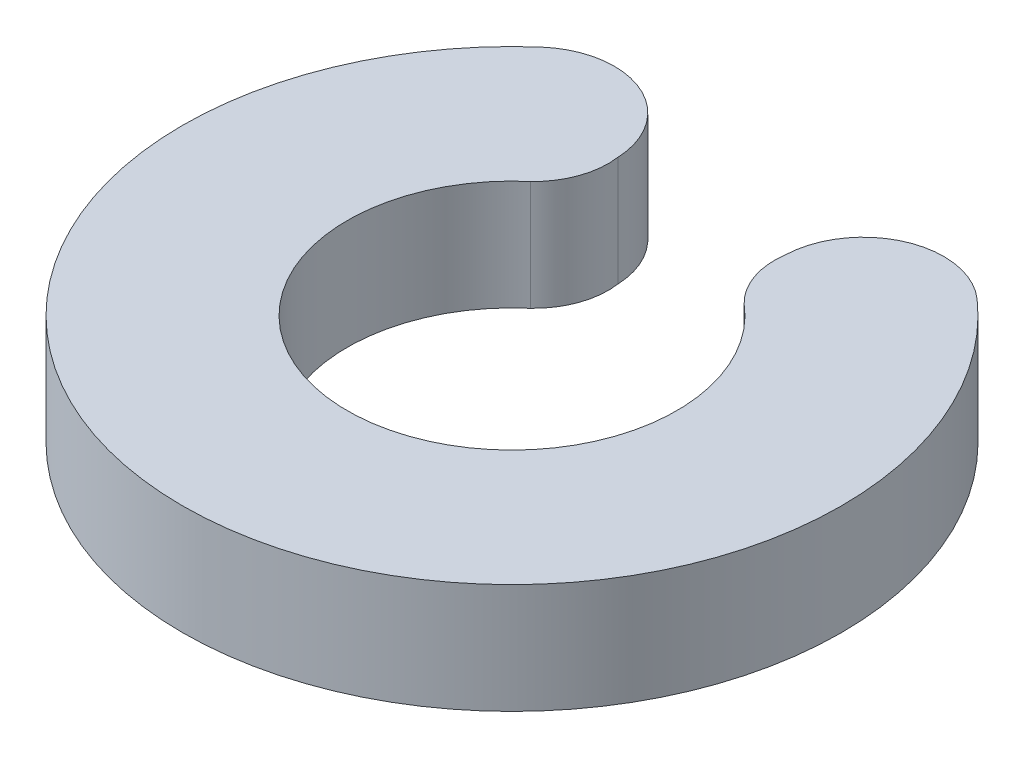
ISO-10303-21;
HEADER;
FILE_DESCRIPTION(('STEP AP214'),'2;1');
FILE_NAME('part.step','',(''),(''),'','','');
FILE_SCHEMA(('AUTOMOTIVE_DESIGN { 1 0 10303 214 1 1 1 1 }'));
ENDSEC;
DATA;
#1=APPLICATION_CONTEXT('core data for automotive mechanical design processes');
#2=APPLICATION_PROTOCOL_DEFINITION('international standard','automotive_design',2000,#1);
#3=PRODUCT_CONTEXT('',#1,'mechanical');
#4=PRODUCT('Part','Part','',(#3));
#5=PRODUCT_RELATED_PRODUCT_CATEGORY('part','',(#4));
#6=PRODUCT_DEFINITION_FORMATION('','',#4);
#7=PRODUCT_DEFINITION_CONTEXT('part definition',#1,'design');
#8=PRODUCT_DEFINITION('design','',#6,#7);
#9=PRODUCT_DEFINITION_SHAPE('','',#8);
#10=(LENGTH_UNIT() NAMED_UNIT(*) SI_UNIT(.MILLI.,.METRE.));
#11=(NAMED_UNIT(*) PLANE_ANGLE_UNIT() SI_UNIT($,.RADIAN.));
#12=(NAMED_UNIT(*) SI_UNIT($,.STERADIAN.) SOLID_ANGLE_UNIT());
#13=UNCERTAINTY_MEASURE_WITH_UNIT(LENGTH_MEASURE(1.E-05),#10,'distance_accuracy_value','');
#14=(GEOMETRIC_REPRESENTATION_CONTEXT(3) GLOBAL_UNCERTAINTY_ASSIGNED_CONTEXT((#13)) GLOBAL_UNIT_ASSIGNED_CONTEXT((#10,
#11,#12)) REPRESENTATION_CONTEXT('',''));
#15=CARTESIAN_POINT('',(0.,0.,0.));
#16=DIRECTION('',(0.,0.,1.));
#17=DIRECTION('',(1.,0.,0.));
#18=AXIS2_PLACEMENT_3D('',#15,#16,#17);
#19=CARTESIAN_POINT('',(2.85767186051075,2.,-3.26379282396494));
#20=DIRECTION('',(0.,-1.,0.));
#21=DIRECTION('',(0.,0.,-1.));
#22=AXIS2_PLACEMENT_3D('',#19,#20,#21);
#23=CYLINDRICAL_SURFACE('',#22,1.33980160261541);
#24=CARTESIAN_POINT('',(2.85767186051075,0.,-3.26379282396494));
#25=DIRECTION('',(0.,1.,0.));
#26=DIRECTION('',(0.,0.,1.));
#27=AXIS2_PLACEMENT_3D('',#24,#25,#26);
#28=CIRCLE('',#27,1.33980160261541);
#29=CARTESIAN_POINT('',(1.93296965263951,0.,-2.29425986365422));
#30=VERTEX_POINT('',#29);
#31=CARTESIAN_POINT('',(1.53197549990226,0.,-3.45769355588777));
#32=VERTEX_POINT('',#31);
#33=EDGE_CURVE('E115',#30,#32,#28,.F.);
#34=ORIENTED_EDGE('',*,*,#33,.F.);
#35=DIRECTION('',(0.,-1.,0.));
#36=VECTOR('',#35,1.);
#37=CARTESIAN_POINT('',(1.93296965263951,2.,-2.29425986365422));
#38=LINE('',#37,#36);
#39=CARTESIAN_POINT('',(1.93296965263951,2.,-2.29425986365422));
#40=VERTEX_POINT('',#39);
#41=EDGE_CURVE('E11',#40,#30,#38,.T.);
#42=ORIENTED_EDGE('',*,*,#41,.F.);
#43=CARTESIAN_POINT('',(2.85767186051075,2.,-3.26379282396494));
#44=DIRECTION('',(0.,1.,0.));
#45=DIRECTION('',(0.,0.,1.));
#46=AXIS2_PLACEMENT_3D('',#43,#44,#45);
#47=CIRCLE('',#46,1.33980160261541);
#48=CARTESIAN_POINT('',(1.53197549990226,2.,-3.45769355588777));
#49=VERTEX_POINT('',#48);
#50=EDGE_CURVE('E127',#40,#49,#47,.F.);
#51=ORIENTED_EDGE('',*,*,#50,.T.);
#52=DIRECTION('',(0.,-1.,0.));
#53=VECTOR('',#52,1.);
#54=CARTESIAN_POINT('',(1.53197549990226,2.,-3.45769355588777));
#55=LINE('',#54,#53);
#56=EDGE_CURVE('E79',#49,#32,#55,.T.);
#57=ORIENTED_EDGE('',*,*,#56,.T.);
#58=EDGE_LOOP('',(#34,#42,#51,#57));
#59=FACE_BOUND('',#58,.T.);
#60=ADVANCED_FACE('F34',(#59),#23,.T.);
#61=CARTESIAN_POINT('',(0.,2.,0.));
#62=DIRECTION('',(0.,-1.,0.));
#63=DIRECTION('',(0.,0.,-1.));
#64=AXIS2_PLACEMENT_3D('',#61,#62,#63);
#65=CYLINDRICAL_SURFACE('',#64,3.);
#66=CARTESIAN_POINT('',(0.,0.,0.));
#67=DIRECTION('',(0.,1.,0.));
#68=DIRECTION('',(0.,0.,1.));
#69=AXIS2_PLACEMENT_3D('',#66,#67,#68);
#70=CIRCLE('',#69,3.);
#71=CARTESIAN_POINT('',(-1.94534353459678,0.,-2.28377725104759));
#72=VERTEX_POINT('',#71);
#73=EDGE_CURVE('E118',#72,#30,#70,.T.);
#74=ORIENTED_EDGE('',*,*,#73,.F.);
#75=DIRECTION('',(0.,-1.,0.));
#76=VECTOR('',#75,1.);
#77=CARTESIAN_POINT('',(-1.94534353459678,2.,-2.28377725104759));
#78=LINE('',#77,#76);
#79=CARTESIAN_POINT('',(-1.94534353459678,2.,-2.28377725104759));
#80=VERTEX_POINT('',#79);
#81=EDGE_CURVE('E42',#80,#72,#78,.T.);
#82=ORIENTED_EDGE('',*,*,#81,.F.);
#83=CARTESIAN_POINT('',(0.,2.,0.));
#84=DIRECTION('',(0.,1.,0.));
#85=DIRECTION('',(0.,0.,1.));
#86=AXIS2_PLACEMENT_3D('',#83,#84,#85);
#87=CIRCLE('',#86,3.);
#88=EDGE_CURVE('E139',#80,#40,#87,.T.);
#89=ORIENTED_EDGE('',*,*,#88,.T.);
#90=ORIENTED_EDGE('',*,*,#41,.T.);
#91=EDGE_LOOP('',(#74,#82,#89,#90));
#92=FACE_BOUND('',#91,.T.);
#93=ADVANCED_FACE('F138',(#92),#65,.F.);
#94=CARTESIAN_POINT('',(-2.88155859532922,2.,-3.273181424374));
#95=DIRECTION('',(0.,-1.,0.));
#96=DIRECTION('',(0.,0.,-1.));
#97=AXIS2_PLACEMENT_3D('',#94,#95,#96);
#98=CYLINDRICAL_SURFACE('',#97,1.36213775299635);
#99=CARTESIAN_POINT('',(-2.88155859532922,0.,-3.273181424374));
#100=DIRECTION('',(0.,1.,0.));
#101=DIRECTION('',(0.,0.,1.));
#102=AXIS2_PLACEMENT_3D('',#99,#100,#101);
#103=CIRCLE('',#102,1.36213775299635);
#104=CARTESIAN_POINT('',(-1.53197549990226,0.,-3.45769355588777));
#105=VERTEX_POINT('',#104);
#106=EDGE_CURVE('E121',#72,#105,#103,.T.);
#107=ORIENTED_EDGE('',*,*,#106,.T.);
#108=DIRECTION('',(0.,-1.,0.));
#109=VECTOR('',#108,1.);
#110=CARTESIAN_POINT('',(-1.53197549990226,2.,-3.45769355588777));
#111=LINE('',#110,#109);
#112=CARTESIAN_POINT('',(-1.53197549990226,2.,-3.45769355588777));
#113=VERTEX_POINT('',#112);
#114=EDGE_CURVE('E107',#113,#105,#111,.T.);
#115=ORIENTED_EDGE('',*,*,#114,.F.);
#116=CARTESIAN_POINT('',(-2.88155859532922,2.,-3.273181424374));
#117=DIRECTION('',(0.,1.,0.));
#118=DIRECTION('',(0.,0.,1.));
#119=AXIS2_PLACEMENT_3D('',#116,#117,#118);
#120=CIRCLE('',#119,1.36213775299635);
#121=EDGE_CURVE('E98',#80,#113,#120,.T.);
#122=ORIENTED_EDGE('',*,*,#121,.F.);
#123=ORIENTED_EDGE('',*,*,#81,.T.);
#124=EDGE_LOOP('',(#107,#115,#122,#123));
#125=FACE_BOUND('',#124,.T.);
#126=ADVANCED_FACE('F132',(#125),#98,.T.);
#127=CARTESIAN_POINT('',(-3.,2.,-3.3951015584615));
#128=DIRECTION('',(0.,-1.,0.));
#129=DIRECTION('',(0.,0.,-1.));
#130=AXIS2_PLACEMENT_3D('',#127,#128,#129);
#131=CYLINDRICAL_SURFACE('',#130,1.46935825823011);
#132=CARTESIAN_POINT('',(-3.,0.,-3.3951015584615));
#133=DIRECTION('',(0.,1.,0.));
#134=DIRECTION('',(0.,0.,1.));
#135=AXIS2_PLACEMENT_3D('',#132,#133,#134);
#136=CIRCLE('',#135,1.46935825823011);
#137=CARTESIAN_POINT('',(-3.97294710681942,0.,-4.49618630468258));
#138=VERTEX_POINT('',#137);
#139=EDGE_CURVE('E106',#105,#138,#136,.T.);
#140=ORIENTED_EDGE('',*,*,#139,.T.);
#141=DIRECTION('',(0.,-1.,0.));
#142=VECTOR('',#141,1.);
#143=CARTESIAN_POINT('',(-3.97294710681942,2.,-4.49618630468258));
#144=LINE('',#143,#142);
#145=CARTESIAN_POINT('',(-3.97294710681942,2.,-4.49618630468258));
#146=VERTEX_POINT('',#145);
#147=EDGE_CURVE('E103',#146,#138,#144,.T.);
#148=ORIENTED_EDGE('',*,*,#147,.F.);
#149=CARTESIAN_POINT('',(-3.,2.,-3.3951015584615));
#150=DIRECTION('',(0.,1.,0.));
#151=DIRECTION('',(0.,0.,1.));
#152=AXIS2_PLACEMENT_3D('',#149,#150,#151);
#153=CIRCLE('',#152,1.46935825823011);
#154=EDGE_CURVE('E91',#113,#146,#153,.T.);
#155=ORIENTED_EDGE('',*,*,#154,.F.);
#156=ORIENTED_EDGE('',*,*,#114,.T.);
#157=EDGE_LOOP('',(#140,#148,#155,#156));
#158=FACE_BOUND('',#157,.T.);
#159=ADVANCED_FACE('F104',(#158),#131,.T.);
#160=CARTESIAN_POINT('',(0.,2.,0.));
#161=DIRECTION('',(0.,-1.,0.));
#162=DIRECTION('',(0.,0.,-1.));
#163=AXIS2_PLACEMENT_3D('',#160,#161,#162);
#164=CYLINDRICAL_SURFACE('',#163,6.);
#165=CARTESIAN_POINT('',(0.,0.,0.));
#166=DIRECTION('',(0.,1.,0.));
#167=DIRECTION('',(0.,0.,1.));
#168=AXIS2_PLACEMENT_3D('',#165,#166,#167);
#169=CIRCLE('',#168,6.);
#170=CARTESIAN_POINT('',(3.97294710681942,0.,-4.49618630468258));
#171=VERTEX_POINT('',#170);
#172=EDGE_CURVE('E72',#138,#171,#169,.T.);
#173=ORIENTED_EDGE('',*,*,#172,.T.);
#174=DIRECTION('',(0.,-1.,0.));
#175=VECTOR('',#174,1.);
#176=CARTESIAN_POINT('',(3.97294710681942,2.,-4.49618630468258));
#177=LINE('',#176,#175);
#178=CARTESIAN_POINT('',(3.97294710681942,2.,-4.49618630468258));
#179=VERTEX_POINT('',#178);
#180=EDGE_CURVE('E108',#179,#171,#177,.T.);
#181=ORIENTED_EDGE('',*,*,#180,.F.);
#182=CARTESIAN_POINT('',(0.,2.,0.));
#183=DIRECTION('',(0.,1.,0.));
#184=DIRECTION('',(0.,0.,1.));
#185=AXIS2_PLACEMENT_3D('',#182,#183,#184);
#186=CIRCLE('',#185,6.);
#187=EDGE_CURVE('E95',#146,#179,#186,.T.);
#188=ORIENTED_EDGE('',*,*,#187,.F.);
#189=ORIENTED_EDGE('',*,*,#147,.T.);
#190=EDGE_LOOP('',(#173,#181,#188,#189));
#191=FACE_BOUND('',#190,.T.);
#192=ADVANCED_FACE('F110',(#191),#164,.T.);
#193=CARTESIAN_POINT('',(3.,2.,-3.3951015584615));
#194=DIRECTION('',(0.,-1.,0.));
#195=DIRECTION('',(0.,0.,-1.));
#196=AXIS2_PLACEMENT_3D('',#193,#194,#195);
#197=CYLINDRICAL_SURFACE('',#196,1.46935825823011);
#198=CARTESIAN_POINT('',(3.,0.,-3.3951015584615));
#199=DIRECTION('',(0.,1.,0.));
#200=DIRECTION('',(0.,0.,1.));
#201=AXIS2_PLACEMENT_3D('',#198,#199,#200);
#202=CIRCLE('',#201,1.46935825823011);
#203=EDGE_CURVE('E125',#171,#32,#202,.T.);
#204=ORIENTED_EDGE('',*,*,#203,.T.);
#205=ORIENTED_EDGE('',*,*,#56,.F.);
#206=CARTESIAN_POINT('',(3.,2.,-3.3951015584615));
#207=DIRECTION('',(0.,1.,0.));
#208=DIRECTION('',(0.,0.,1.));
#209=AXIS2_PLACEMENT_3D('',#206,#207,#208);
#210=CIRCLE('',#209,1.46935825823011);
#211=EDGE_CURVE('E50',#179,#49,#210,.T.);
#212=ORIENTED_EDGE('',*,*,#211,.F.);
#213=ORIENTED_EDGE('',*,*,#180,.T.);
#214=EDGE_LOOP('',(#204,#205,#212,#213));
#215=FACE_BOUND('',#214,.T.);
#216=ADVANCED_FACE('F142',(#215),#197,.T.);
#217=CARTESIAN_POINT('',(0.,2.,0.));
#218=DIRECTION('',(0.,1.,0.));
#219=DIRECTION('',(0.,0.,1.));
#220=AXIS2_PLACEMENT_3D('',#217,#218,#219);
#221=PLANE('',#220);
#222=ORIENTED_EDGE('',*,*,#50,.F.);
#223=ORIENTED_EDGE('',*,*,#88,.F.);
#224=ORIENTED_EDGE('',*,*,#121,.T.);
#225=ORIENTED_EDGE('',*,*,#154,.T.);
#226=ORIENTED_EDGE('',*,*,#187,.T.);
#227=ORIENTED_EDGE('',*,*,#211,.T.);
#228=EDGE_LOOP('',(#222,#223,#224,#225,#226,#227));
#229=FACE_BOUND('',#228,.T.);
#230=ADVANCED_FACE('F93',(#229),#221,.T.);
#231=CARTESIAN_POINT('',(0.,0.,0.));
#232=DIRECTION('',(0.,1.,0.));
#233=DIRECTION('',(0.,0.,1.));
#234=AXIS2_PLACEMENT_3D('',#231,#232,#233);
#235=PLANE('',#234);
#236=ORIENTED_EDGE('',*,*,#33,.T.);
#237=ORIENTED_EDGE('',*,*,#203,.F.);
#238=ORIENTED_EDGE('',*,*,#172,.F.);
#239=ORIENTED_EDGE('',*,*,#139,.F.);
#240=ORIENTED_EDGE('',*,*,#106,.F.);
#241=ORIENTED_EDGE('',*,*,#73,.T.);
#242=EDGE_LOOP('',(#236,#237,#238,#239,#240,#241));
#243=FACE_BOUND('',#242,.T.);
#244=ADVANCED_FACE('F137',(#243),#235,.F.);
#245=CLOSED_SHELL('',(#60,#93,#126,#159,#192,#216,#230,#244));
#246=MANIFOLD_SOLID_BREP('B2',#245);
#247=ADVANCED_BREP_SHAPE_REPRESENTATION('',(#18,#246),#14);
#248=SHAPE_DEFINITION_REPRESENTATION(#9,#247);
ENDSEC;
END-ISO-10303-21;
